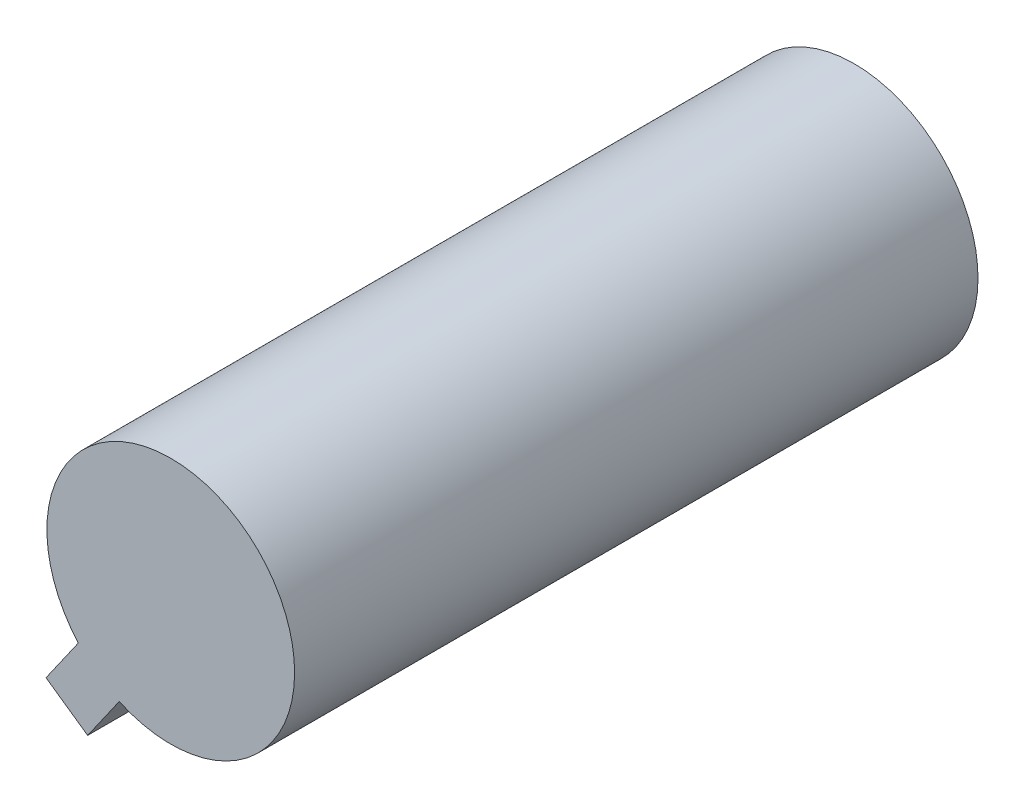
ISO-10303-21;
HEADER;
FILE_DESCRIPTION(('STEP AP214'),'2;1');
FILE_NAME('part.step','',(''),(''),'','','');
FILE_SCHEMA(('AUTOMOTIVE_DESIGN { 1 0 10303 214 1 1 1 1 }'));
ENDSEC;
DATA;
#1=APPLICATION_CONTEXT('core data for automotive mechanical design processes');
#2=APPLICATION_PROTOCOL_DEFINITION('international standard','automotive_design',2000,#1);
#3=PRODUCT_CONTEXT('',#1,'mechanical');
#4=PRODUCT('Part','Part','',(#3));
#5=PRODUCT_RELATED_PRODUCT_CATEGORY('part','',(#4));
#6=PRODUCT_DEFINITION_FORMATION('','',#4);
#7=PRODUCT_DEFINITION_CONTEXT('part definition',#1,'design');
#8=PRODUCT_DEFINITION('design','',#6,#7);
#9=PRODUCT_DEFINITION_SHAPE('','',#8);
#10=(LENGTH_UNIT() NAMED_UNIT(*) SI_UNIT(.MILLI.,.METRE.));
#11=(NAMED_UNIT(*) PLANE_ANGLE_UNIT() SI_UNIT($,.RADIAN.));
#12=(NAMED_UNIT(*) SI_UNIT($,.STERADIAN.) SOLID_ANGLE_UNIT());
#13=UNCERTAINTY_MEASURE_WITH_UNIT(LENGTH_MEASURE(1.E-05),#10,'distance_accuracy_value','');
#14=(GEOMETRIC_REPRESENTATION_CONTEXT(3) GLOBAL_UNCERTAINTY_ASSIGNED_CONTEXT((#13)) GLOBAL_UNIT_ASSIGNED_CONTEXT((#10,
#11,#12)) REPRESENTATION_CONTEXT('',''));
#15=CARTESIAN_POINT('',(0.,0.,0.));
#16=DIRECTION('',(0.,0.,1.));
#17=DIRECTION('',(1.,0.,0.));
#18=AXIS2_PLACEMENT_3D('',#15,#16,#17);
#19=CARTESIAN_POINT('',(0.,0.,38.63));
#20=DIRECTION('',(0.,0.,-1.));
#21=DIRECTION('',(-1.,0.,0.));
#22=AXIS2_PLACEMENT_3D('',#19,#20,#21);
#23=CYLINDRICAL_SURFACE('',#22,7.);
#24=DIRECTION('',(0.,0.,-1.));
#25=VECTOR('',#24,1.);
#26=CARTESIAN_POINT('',(-5.22413772764699,-4.65922579433272,38.63));
#27=LINE('',#26,#25);
#28=CARTESIAN_POINT('',(-5.22413772764699,-4.65922579433272,38.63));
#29=VERTEX_POINT('',#28);
#30=CARTESIAN_POINT('',(-5.22413772764699,-4.65922579433272,24.9612892222378));
#31=VERTEX_POINT('',#30);
#32=EDGE_CURVE('E153',#29,#31,#27,.T.);
#33=ORIENTED_EDGE('',*,*,#32,.F.);
#34=CARTESIAN_POINT('',(0.,0.,38.63));
#35=DIRECTION('',(0.,0.,1.));
#36=DIRECTION('',(1.,0.,0.));
#37=AXIS2_PLACEMENT_3D('',#34,#35,#36);
#38=CIRCLE('',#37,7.);
#39=CARTESIAN_POINT('',(-2.91180538165941,-6.36564132034938,38.63));
#40=VERTEX_POINT('',#39);
#41=EDGE_CURVE('E157',#40,#29,#38,.T.);
#42=ORIENTED_EDGE('',*,*,#41,.F.);
#43=DIRECTION('',(0.,0.,-1.));
#44=VECTOR('',#43,1.);
#45=CARTESIAN_POINT('',(-2.91180538165941,-6.36564132034938,38.63));
#46=LINE('',#45,#44);
#47=CARTESIAN_POINT('',(-2.91180538165941,-6.36564132034937,24.9612892222378));
#48=VERTEX_POINT('',#47);
#49=EDGE_CURVE('E150',#48,#40,#46,.F.);
#50=ORIENTED_EDGE('',*,*,#49,.F.);
#51=CARTESIAN_POINT('',(0.,0.,24.9612892222378));
#52=DIRECTION('',(0.,0.,1.));
#53=DIRECTION('',(1.,0.,0.));
#54=AXIS2_PLACEMENT_3D('',#51,#52,#53);
#55=CIRCLE('',#54,7.);
#56=EDGE_CURVE('E42',#31,#48,#55,.T.);
#57=ORIENTED_EDGE('',*,*,#56,.F.);
#58=EDGE_LOOP('',(#33,#42,#50,#57));
#59=FACE_BOUND('',#58,.T.);
#60=DIRECTION('',(0.,0.,-1.));
#61=VECTOR('',#60,1.);
#62=CARTESIAN_POINT('',(-2.91180538165941,-6.36564132034937,38.63));
#63=LINE('',#62,#61);
#64=CARTESIAN_POINT('',(-2.91180538165941,-6.36564132034937,0.));
#65=VERTEX_POINT('',#64);
#66=CARTESIAN_POINT('',(-2.91180538165941,-6.36564132034937,13.2033104374943));
#67=VERTEX_POINT('',#66);
#68=EDGE_CURVE('E51',#65,#67,#63,.F.);
#69=ORIENTED_EDGE('',*,*,#68,.F.);
#70=CARTESIAN_POINT('',(0.,0.,0.));
#71=DIRECTION('',(0.,0.,1.));
#72=DIRECTION('',(1.,0.,0.));
#73=AXIS2_PLACEMENT_3D('',#70,#71,#72);
#74=CIRCLE('',#73,7.);
#75=CARTESIAN_POINT('',(-5.22413772764699,-4.65922579433272,0.));
#76=VERTEX_POINT('',#75);
#77=EDGE_CURVE('E156',#65,#76,#74,.T.);
#78=ORIENTED_EDGE('',*,*,#77,.T.);
#79=DIRECTION('',(0.,0.,-1.));
#80=VECTOR('',#79,1.);
#81=CARTESIAN_POINT('',(-5.22413772764699,-4.65922579433272,38.63));
#82=LINE('',#81,#80);
#83=CARTESIAN_POINT('',(-5.22413772764699,-4.65922579433272,13.2033104374943));
#84=VERTEX_POINT('',#83);
#85=EDGE_CURVE('E126',#84,#76,#82,.T.);
#86=ORIENTED_EDGE('',*,*,#85,.F.);
#87=CARTESIAN_POINT('',(0.,0.,13.2033104374943));
#88=DIRECTION('',(0.,0.,-1.));
#89=DIRECTION('',(-1.,0.,0.));
#90=AXIS2_PLACEMENT_3D('',#87,#88,#89);
#91=CIRCLE('',#90,7.);
#92=EDGE_CURVE('E11',#67,#84,#91,.T.);
#93=ORIENTED_EDGE('',*,*,#92,.F.);
#94=EDGE_LOOP('',(#69,#78,#86,#93));
#95=FACE_BOUND('',#94,.T.);
#96=ADVANCED_FACE('F35',(#59,#95),#23,.T.);
#97=CARTESIAN_POINT('',(0.,0.,38.63));
#98=DIRECTION('',(0.,0.,1.));
#99=DIRECTION('',(1.,0.,0.));
#100=AXIS2_PLACEMENT_3D('',#97,#98,#99);
#101=PLANE('',#100);
#102=DIRECTION('',(-0.573409167888029,-0.819269141480355,0.));
#103=VECTOR('',#102,1.);
#104=CARTESIAN_POINT('',(0.402570689635414,3.38003976426646,38.6300000000003));
#105=LINE('',#104,#103);
#106=CARTESIAN_POINT('',(-7.05174849290897,-7.27045907497815,38.6300000000003));
#107=VERTEX_POINT('',#106);
#108=EDGE_CURVE('E148',#29,#107,#105,.T.);
#109=ORIENTED_EDGE('',*,*,#108,.T.);
#110=DIRECTION('',(-0.819269141480355,0.573409167888029,0.));
#111=VECTOR('',#110,1.);
#112=CARTESIAN_POINT('',(-4.69807276298023,-8.9178044630127,38.6300000000003));
#113=LINE('',#112,#111);
#114=CARTESIAN_POINT('',(-4.69807276298023,-8.9178044630127,38.6300000000003));
#115=VERTEX_POINT('',#114);
#116=EDGE_CURVE('E133',#115,#107,#113,.T.);
#117=ORIENTED_EDGE('',*,*,#116,.F.);
#118=DIRECTION('',(-0.573409167888029,-0.819269141480355,0.));
#119=VECTOR('',#118,1.);
#120=CARTESIAN_POINT('',(2.75624641956415,1.73269437623191,38.6300000000003));
#121=LINE('',#120,#119);
#122=EDGE_CURVE('E146',#40,#115,#121,.T.);
#123=ORIENTED_EDGE('',*,*,#122,.F.);
#124=ORIENTED_EDGE('',*,*,#41,.T.);
#125=EDGE_LOOP('',(#109,#117,#123,#124));
#126=FACE_BOUND('',#125,.T.);
#127=ADVANCED_FACE('F179',(#126),#101,.T.);
#128=CARTESIAN_POINT('',(0.,0.,0.));
#129=DIRECTION('',(0.,0.,1.));
#130=DIRECTION('',(1.,0.,0.));
#131=AXIS2_PLACEMENT_3D('',#128,#129,#130);
#132=PLANE('',#131);
#133=ORIENTED_EDGE('',*,*,#77,.F.);
#134=DIRECTION('',(-0.573409167888029,-0.819269141480355,0.));
#135=VECTOR('',#134,1.);
#136=CARTESIAN_POINT('',(2.75624641956415,1.73269437623191,0.));
#137=LINE('',#136,#135);
#138=CARTESIAN_POINT('',(-4.69807276298023,-8.9178044630127,0.));
#139=VERTEX_POINT('',#138);
#140=EDGE_CURVE('E124',#65,#139,#137,.T.);
#141=ORIENTED_EDGE('',*,*,#140,.T.);
#142=DIRECTION('',(0.819269141480355,-0.573409167888029,0.));
#143=VECTOR('',#142,1.);
#144=CARTESIAN_POINT('',(-4.69807276298023,-8.9178044630127,0.));
#145=LINE('',#144,#143);
#146=CARTESIAN_POINT('',(-7.05174849290897,-7.27045907497815,0.));
#147=VERTEX_POINT('',#146);
#148=EDGE_CURVE('E103',#147,#139,#145,.T.);
#149=ORIENTED_EDGE('',*,*,#148,.F.);
#150=DIRECTION('',(-0.573409167888029,-0.819269141480355,0.));
#151=VECTOR('',#150,1.);
#152=CARTESIAN_POINT('',(0.402570689635413,3.38003976426646,0.));
#153=LINE('',#152,#151);
#154=EDGE_CURVE('E122',#76,#147,#153,.T.);
#155=ORIENTED_EDGE('',*,*,#154,.F.);
#156=EDGE_LOOP('',(#133,#141,#149,#155));
#157=FACE_BOUND('',#156,.T.);
#158=ADVANCED_FACE('F181',(#157),#132,.F.);
#159=CARTESIAN_POINT('',(0.402570689635413,3.38003976426646,24.9612892222378));
#160=DIRECTION('',(0.,0.,1.));
#161=DIRECTION('',(1.,0.,0.));
#162=AXIS2_PLACEMENT_3D('',#159,#160,#161);
#163=PLANE('',#162);
#164=DIRECTION('',(-0.573409167888029,-0.819269141480355,0.));
#165=VECTOR('',#164,1.);
#166=CARTESIAN_POINT('',(0.402570689635413,3.38003976426646,24.9612892222378));
#167=LINE('',#166,#165);
#168=CARTESIAN_POINT('',(-7.05174849290897,-7.27045907497815,24.9612892222378));
#169=VERTEX_POINT('',#168);
#170=EDGE_CURVE('E142',#31,#169,#167,.T.);
#171=ORIENTED_EDGE('',*,*,#170,.F.);
#172=ORIENTED_EDGE('',*,*,#56,.T.);
#173=DIRECTION('',(-0.573409167888029,-0.819269141480355,0.));
#174=VECTOR('',#173,1.);
#175=CARTESIAN_POINT('',(2.75624641956414,1.73269437623192,24.9612892222378));
#176=LINE('',#175,#174);
#177=CARTESIAN_POINT('',(-4.69807276298023,-8.9178044630127,24.9612892222378));
#178=VERTEX_POINT('',#177);
#179=EDGE_CURVE('E144',#48,#178,#176,.T.);
#180=ORIENTED_EDGE('',*,*,#179,.T.);
#181=DIRECTION('',(0.819269141480355,-0.573409167888029,0.));
#182=VECTOR('',#181,1.);
#183=CARTESIAN_POINT('',(-4.69807276298023,-8.9178044630127,24.9612892222378));
#184=LINE('',#183,#182);
#185=EDGE_CURVE('E139',#169,#178,#184,.T.);
#186=ORIENTED_EDGE('',*,*,#185,.F.);
#187=EDGE_LOOP('',(#171,#172,#180,#186));
#188=FACE_BOUND('',#187,.T.);
#189=ADVANCED_FACE('F164',(#188),#163,.F.);
#190=CARTESIAN_POINT('',(0.402570689635413,3.38003976426646,24.9612892222378));
#191=DIRECTION('',(0.819269141480355,-0.573409167888029,0.));
#192=DIRECTION('',(0.573409167888029,0.819269141480355,0.));
#193=AXIS2_PLACEMENT_3D('',#190,#191,#192);
#194=PLANE('',#193);
#195=ORIENTED_EDGE('',*,*,#108,.F.);
#196=ORIENTED_EDGE('',*,*,#32,.T.);
#197=ORIENTED_EDGE('',*,*,#170,.T.);
#198=DIRECTION('',(0.,0.,-1.));
#199=VECTOR('',#198,1.);
#200=CARTESIAN_POINT('',(-7.05174849290897,-7.27045907497815,38.6300000000003));
#201=LINE('',#200,#199);
#202=EDGE_CURVE('E136',#107,#169,#201,.T.);
#203=ORIENTED_EDGE('',*,*,#202,.F.);
#204=EDGE_LOOP('',(#195,#196,#197,#203));
#205=FACE_BOUND('',#204,.T.);
#206=ADVANCED_FACE('F177',(#205),#194,.F.);
#207=CARTESIAN_POINT('',(2.75624641956414,1.73269437623192,24.9612892222378));
#208=DIRECTION('',(-0.819269141480355,0.573409167888029,0.));
#209=DIRECTION('',(-0.573409167888029,-0.819269141480355,0.));
#210=AXIS2_PLACEMENT_3D('',#207,#208,#209);
#211=PLANE('',#210);
#212=ORIENTED_EDGE('',*,*,#179,.F.);
#213=ORIENTED_EDGE('',*,*,#49,.T.);
#214=ORIENTED_EDGE('',*,*,#122,.T.);
#215=DIRECTION('',(0.,0.,1.));
#216=VECTOR('',#215,1.);
#217=CARTESIAN_POINT('',(-4.69807276298023,-8.9178044630127,38.6300000000003));
#218=LINE('',#217,#216);
#219=EDGE_CURVE('E130',#178,#115,#218,.T.);
#220=ORIENTED_EDGE('',*,*,#219,.F.);
#221=EDGE_LOOP('',(#212,#213,#214,#220));
#222=FACE_BOUND('',#221,.T.);
#223=ADVANCED_FACE('F169',(#222),#211,.F.);
#224=CARTESIAN_POINT('',(-5.7340916788803,-8.19269141480356,0.));
#225=DIRECTION('',(0.573409167888029,0.819269141480355,0.));
#226=DIRECTION('',(-0.819269141480355,0.573409167888029,0.));
#227=AXIS2_PLACEMENT_3D('',#224,#225,#226);
#228=PLANE('',#227);
#229=ORIENTED_EDGE('',*,*,#219,.T.);
#230=ORIENTED_EDGE('',*,*,#116,.T.);
#231=ORIENTED_EDGE('',*,*,#202,.T.);
#232=ORIENTED_EDGE('',*,*,#185,.T.);
#233=EDGE_LOOP('',(#229,#230,#231,#232));
#234=FACE_BOUND('',#233,.T.);
#235=ADVANCED_FACE('F173',(#234),#228,.F.);
#236=CARTESIAN_POINT('',(2.75624641956415,1.73269437623191,13.2033104374943));
#237=DIRECTION('',(0.,0.,-1.));
#238=DIRECTION('',(-1.,0.,0.));
#239=AXIS2_PLACEMENT_3D('',#236,#237,#238);
#240=PLANE('',#239);
#241=DIRECTION('',(-0.573409167888029,-0.819269141480355,0.));
#242=VECTOR('',#241,1.);
#243=CARTESIAN_POINT('',(2.75624641956415,1.73269437623191,13.2033104374943));
#244=LINE('',#243,#242);
#245=CARTESIAN_POINT('',(-4.69807276298023,-8.9178044630127,13.2033104374943));
#246=VERTEX_POINT('',#245);
#247=EDGE_CURVE('E95',#67,#246,#244,.T.);
#248=ORIENTED_EDGE('',*,*,#247,.F.);
#249=ORIENTED_EDGE('',*,*,#92,.T.);
#250=DIRECTION('',(-0.573409167888029,-0.819269141480355,0.));
#251=VECTOR('',#250,1.);
#252=CARTESIAN_POINT('',(0.402570689635413,3.38003976426646,13.2033104374943));
#253=LINE('',#252,#251);
#254=CARTESIAN_POINT('',(-7.05174849290897,-7.27045907497815,13.2033104374943));
#255=VERTEX_POINT('',#254);
#256=EDGE_CURVE('E102',#84,#255,#253,.T.);
#257=ORIENTED_EDGE('',*,*,#256,.T.);
#258=DIRECTION('',(-0.819269141480355,0.573409167888029,0.));
#259=VECTOR('',#258,1.);
#260=CARTESIAN_POINT('',(-4.69807276298023,-8.9178044630127,13.2033104374943));
#261=LINE('',#260,#259);
#262=EDGE_CURVE('E106',#246,#255,#261,.T.);
#263=ORIENTED_EDGE('',*,*,#262,.F.);
#264=EDGE_LOOP('',(#248,#249,#257,#263));
#265=FACE_BOUND('',#264,.T.);
#266=ADVANCED_FACE('F107',(#265),#240,.F.);
#267=CARTESIAN_POINT('',(2.75624641956415,1.73269437623191,0.));
#268=DIRECTION('',(-0.819269141480355,0.573409167888029,0.));
#269=DIRECTION('',(-0.573409167888029,-0.819269141480355,0.));
#270=AXIS2_PLACEMENT_3D('',#267,#268,#269);
#271=PLANE('',#270);
#272=ORIENTED_EDGE('',*,*,#140,.F.);
#273=ORIENTED_EDGE('',*,*,#68,.T.);
#274=ORIENTED_EDGE('',*,*,#247,.T.);
#275=DIRECTION('',(0.,0.,1.));
#276=VECTOR('',#275,1.);
#277=CARTESIAN_POINT('',(-4.69807276298023,-8.9178044630127,0.));
#278=LINE('',#277,#276);
#279=EDGE_CURVE('E100',#139,#246,#278,.T.);
#280=ORIENTED_EDGE('',*,*,#279,.F.);
#281=EDGE_LOOP('',(#272,#273,#274,#280));
#282=FACE_BOUND('',#281,.T.);
#283=ADVANCED_FACE('F98',(#282),#271,.F.);
#284=CARTESIAN_POINT('',(0.402570689635413,3.38003976426646,0.));
#285=DIRECTION('',(0.819269141480355,-0.573409167888029,0.));
#286=DIRECTION('',(0.573409167888029,0.819269141480355,0.));
#287=AXIS2_PLACEMENT_3D('',#284,#285,#286);
#288=PLANE('',#287);
#289=ORIENTED_EDGE('',*,*,#256,.F.);
#290=ORIENTED_EDGE('',*,*,#85,.T.);
#291=ORIENTED_EDGE('',*,*,#154,.T.);
#292=DIRECTION('',(0.,0.,-1.));
#293=VECTOR('',#292,1.);
#294=CARTESIAN_POINT('',(-7.05174849290897,-7.27045907497815,0.));
#295=LINE('',#294,#293);
#296=EDGE_CURVE('E112',#255,#147,#295,.T.);
#297=ORIENTED_EDGE('',*,*,#296,.F.);
#298=EDGE_LOOP('',(#289,#290,#291,#297));
#299=FACE_BOUND('',#298,.T.);
#300=ADVANCED_FACE('F200',(#299),#288,.F.);
#301=CARTESIAN_POINT('',(-5.73409167888029,-8.19269141480355,0.));
#302=DIRECTION('',(-0.573409167888029,-0.819269141480355,0.));
#303=DIRECTION('',(0.819269141480355,-0.573409167888029,0.));
#304=AXIS2_PLACEMENT_3D('',#301,#302,#303);
#305=PLANE('',#304);
#306=ORIENTED_EDGE('',*,*,#279,.T.);
#307=ORIENTED_EDGE('',*,*,#262,.T.);
#308=ORIENTED_EDGE('',*,*,#296,.T.);
#309=ORIENTED_EDGE('',*,*,#148,.T.);
#310=EDGE_LOOP('',(#306,#307,#308,#309));
#311=FACE_BOUND('',#310,.T.);
#312=ADVANCED_FACE('F115',(#311),#305,.T.);
#313=CLOSED_SHELL('',(#96,#127,#158,#189,#206,#223,#235,#266,#283,#300,#312));
#314=MANIFOLD_SOLID_BREP('B2',#313);
#315=ADVANCED_BREP_SHAPE_REPRESENTATION('',(#18,#314),#14);
#316=SHAPE_DEFINITION_REPRESENTATION(#9,#315);
ENDSEC;
END-ISO-10303-21;
